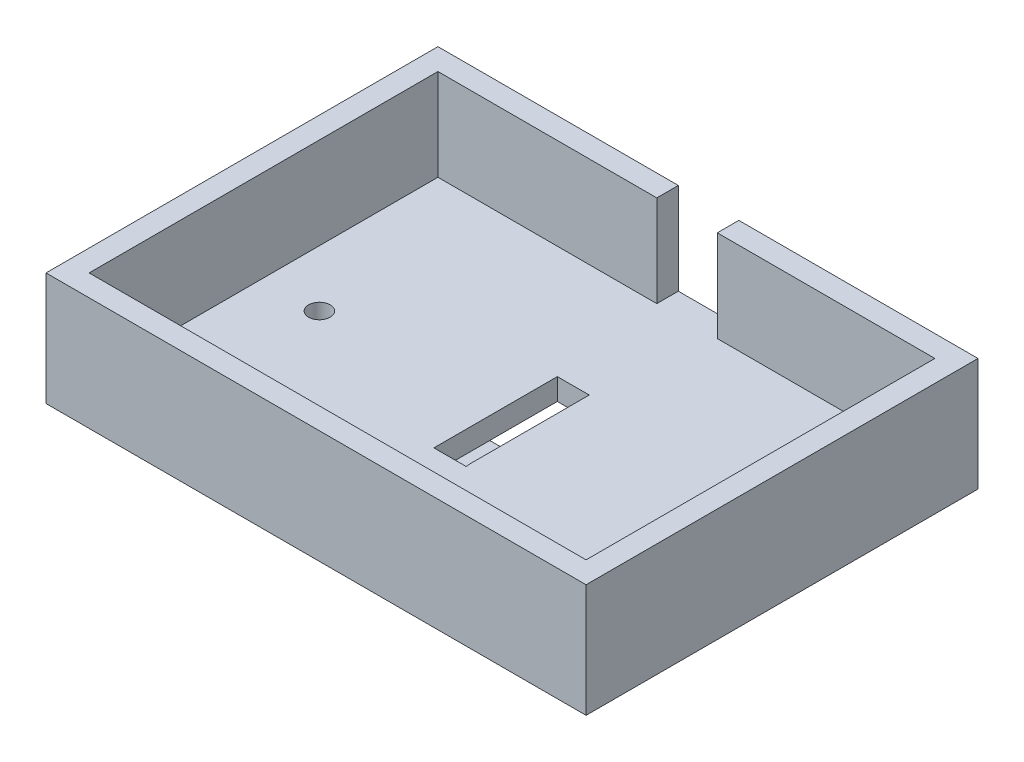
ISO-10303-21;
HEADER;
FILE_DESCRIPTION(('STEP AP214'),'2;1');
FILE_NAME('part.step','',(''),(''),'','','');
FILE_SCHEMA(('AUTOMOTIVE_DESIGN { 1 0 10303 214 1 1 1 1 }'));
ENDSEC;
DATA;
#1=APPLICATION_CONTEXT('core data for automotive mechanical design processes');
#2=APPLICATION_PROTOCOL_DEFINITION('international standard','automotive_design',2000,#1);
#3=PRODUCT_CONTEXT('',#1,'mechanical');
#4=PRODUCT('Part','Part','',(#3));
#5=PRODUCT_RELATED_PRODUCT_CATEGORY('part','',(#4));
#6=PRODUCT_DEFINITION_FORMATION('','',#4);
#7=PRODUCT_DEFINITION_CONTEXT('part definition',#1,'design');
#8=PRODUCT_DEFINITION('design','',#6,#7);
#9=PRODUCT_DEFINITION_SHAPE('','',#8);
#10=(LENGTH_UNIT() NAMED_UNIT(*) SI_UNIT(.MILLI.,.METRE.));
#11=(NAMED_UNIT(*) PLANE_ANGLE_UNIT() SI_UNIT($,.RADIAN.));
#12=(NAMED_UNIT(*) SI_UNIT($,.STERADIAN.) SOLID_ANGLE_UNIT());
#13=UNCERTAINTY_MEASURE_WITH_UNIT(LENGTH_MEASURE(1.E-05),#10,'distance_accuracy_value','');
#14=(GEOMETRIC_REPRESENTATION_CONTEXT(3) GLOBAL_UNCERTAINTY_ASSIGNED_CONTEXT((#13)) GLOBAL_UNIT_ASSIGNED_CONTEXT((#10,
#11,#12)) REPRESENTATION_CONTEXT('',''));
#15=CARTESIAN_POINT('',(0.,0.,0.));
#16=DIRECTION('',(0.,0.,1.));
#17=DIRECTION('',(1.,0.,0.));
#18=AXIS2_PLACEMENT_3D('',#15,#16,#17);
#19=CARTESIAN_POINT('',(0.,21.,-25.9534127843987));
#20=DIRECTION('',(0.,0.,-1.));
#21=DIRECTION('',(-1.,0.,0.));
#22=AXIS2_PLACEMENT_3D('',#19,#20,#21);
#23=PLANE('',#22);
#24=DIRECTION('',(1.,0.,0.));
#25=VECTOR('',#24,1.);
#26=CARTESIAN_POINT('',(0.,21.,-25.9534127843987));
#27=LINE('',#26,#25);
#28=CARTESIAN_POINT('',(9.94358737111857,21.,-25.9534127843987));
#29=VERTEX_POINT('',#28);
#30=CARTESIAN_POINT('',(50.3358613217768,21.,-25.9534127843987));
#31=VERTEX_POINT('',#30);
#32=EDGE_CURVE('E399',#29,#31,#27,.T.);
#33=ORIENTED_EDGE('',*,*,#32,.F.);
#34=DIRECTION('',(0.,-1.,0.));
#35=VECTOR('',#34,1.);
#36=CARTESIAN_POINT('',(9.94358737111857,21.,-25.9534127843987));
#37=LINE('',#36,#35);
#38=CARTESIAN_POINT('',(9.94358737111857,4.,-25.9534127843987));
#39=VERTEX_POINT('',#38);
#40=EDGE_CURVE('E285',#29,#39,#37,.T.);
#41=ORIENTED_EDGE('',*,*,#40,.T.);
#42=DIRECTION('',(-1.,0.,0.));
#43=VECTOR('',#42,1.);
#44=CARTESIAN_POINT('',(0.,4.,-25.9534127843987));
#45=LINE('',#44,#43);
#46=CARTESIAN_POINT('',(50.3358613217768,4.00000000000001,-25.9534127843987));
#47=VERTEX_POINT('',#46);
#48=EDGE_CURVE('E429',#47,#39,#45,.T.);
#49=ORIENTED_EDGE('',*,*,#48,.F.);
#50=DIRECTION('',(0.,-1.,0.));
#51=VECTOR('',#50,1.);
#52=CARTESIAN_POINT('',(50.3358613217768,21.,-25.9534127843987));
#53=LINE('',#52,#51);
#54=EDGE_CURVE('E416',#31,#47,#53,.T.);
#55=ORIENTED_EDGE('',*,*,#54,.F.);
#56=EDGE_LOOP('',(#33,#41,#49,#55));
#57=FACE_BOUND('',#56,.T.);
#58=ADVANCED_FACE('F41',(#57),#23,.F.);
#59=CARTESIAN_POINT('',(0.,-9.5,21.9215872156013));
#60=DIRECTION('',(0.,0.,1.));
#61=DIRECTION('',(1.,0.,0.));
#62=AXIS2_PLACEMENT_3D('',#59,#60,#61);
#63=PLANE('',#62);
#64=DIRECTION('',(1.,0.,0.));
#65=VECTOR('',#64,1.);
#66=CARTESIAN_POINT('',(0.,-5.5,21.9215872156013));
#67=LINE('',#66,#65);
#68=CARTESIAN_POINT('',(8.7108613217768,-5.5,21.9215872156013));
#69=VERTEX_POINT('',#68);
#70=CARTESIAN_POINT('',(12.7108613217768,-5.5,21.9215872156013));
#71=VERTEX_POINT('',#70);
#72=EDGE_CURVE('E64',#69,#71,#67,.T.);
#73=ORIENTED_EDGE('',*,*,#72,.F.);
#74=DIRECTION('',(0.,1.,0.));
#75=VECTOR('',#74,1.);
#76=CARTESIAN_POINT('',(8.7108613217768,-9.5,21.9215872156013));
#77=LINE('',#76,#75);
#78=CARTESIAN_POINT('',(8.7108613217768,0.,21.9215872156013));
#79=VERTEX_POINT('',#78);
#80=EDGE_CURVE('E362',#69,#79,#77,.T.);
#81=ORIENTED_EDGE('',*,*,#80,.T.);
#82=DIRECTION('',(1.,0.,0.));
#83=VECTOR('',#82,1.);
#84=CARTESIAN_POINT('',(0.,0.,21.9215872156013));
#85=LINE('',#84,#83);
#86=CARTESIAN_POINT('',(12.7108613217768,0.,21.9215872156013));
#87=VERTEX_POINT('',#86);
#88=EDGE_CURVE('E353',#79,#87,#85,.T.);
#89=ORIENTED_EDGE('',*,*,#88,.T.);
#90=DIRECTION('',(0.,1.,0.));
#91=VECTOR('',#90,1.);
#92=CARTESIAN_POINT('',(12.7108613217768,-9.5,21.9215872156013));
#93=LINE('',#92,#91);
#94=EDGE_CURVE('E379',#71,#87,#93,.T.);
#95=ORIENTED_EDGE('',*,*,#94,.F.);
#96=EDGE_LOOP('',(#73,#81,#89,#95));
#97=FACE_BOUND('',#96,.T.);
#98=ADVANCED_FACE('F491',(#97),#63,.F.);
#99=CARTESIAN_POINT('',(0.,-9.5,22.0465872156013));
#100=DIRECTION('',(0.,0.,-1.));
#101=DIRECTION('',(-1.,0.,0.));
#102=AXIS2_PLACEMENT_3D('',#99,#100,#101);
#103=PLANE('',#102);
#104=DIRECTION('',(0.,1.,0.));
#105=VECTOR('',#104,1.);
#106=CARTESIAN_POINT('',(-0.289138678223199,-9.5,22.0465872156013));
#107=LINE('',#106,#105);
#108=CARTESIAN_POINT('',(-0.289138678223199,-5.5,22.0465872156013));
#109=VERTEX_POINT('',#108);
#110=CARTESIAN_POINT('',(-0.289138678223199,0.,22.0465872156013));
#111=VERTEX_POINT('',#110);
#112=EDGE_CURVE('E349',#109,#111,#107,.T.);
#113=ORIENTED_EDGE('',*,*,#112,.F.);
#114=DIRECTION('',(1.,0.,0.));
#115=VECTOR('',#114,1.);
#116=CARTESIAN_POINT('',(-4.2891386782232,-5.5,22.0465872156013));
#117=LINE('',#116,#115);
#118=CARTESIAN_POINT('',(-4.2891386782232,-5.5,22.0465872156013));
#119=VERTEX_POINT('',#118);
#120=EDGE_CURVE('E305',#119,#109,#117,.T.);
#121=ORIENTED_EDGE('',*,*,#120,.F.);
#122=DIRECTION('',(0.,1.,0.));
#123=VECTOR('',#122,1.);
#124=CARTESIAN_POINT('',(-4.2891386782232,-9.5,22.0465872156013));
#125=LINE('',#124,#123);
#126=CARTESIAN_POINT('',(-4.2891386782232,0.,22.0465872156013));
#127=VERTEX_POINT('',#126);
#128=EDGE_CURVE('E351',#119,#127,#125,.T.);
#129=ORIENTED_EDGE('',*,*,#128,.T.);
#130=DIRECTION('',(-1.,0.,0.));
#131=VECTOR('',#130,1.);
#132=CARTESIAN_POINT('',(0.,0.,22.0465872156013));
#133=LINE('',#132,#131);
#134=EDGE_CURVE('E336',#111,#127,#133,.T.);
#135=ORIENTED_EDGE('',*,*,#134,.F.);
#136=EDGE_LOOP('',(#113,#121,#129,#135));
#137=FACE_BOUND('',#136,.T.);
#138=ADVANCED_FACE('F497',(#137),#103,.T.);
#139=CARTESIAN_POINT('',(0.,0.,0.));
#140=DIRECTION('',(0.,1.,0.));
#141=DIRECTION('',(0.,0.,1.));
#142=AXIS2_PLACEMENT_3D('',#139,#140,#141);
#143=PLANE('',#142);
#144=ORIENTED_EDGE('',*,*,#134,.T.);
#145=DIRECTION('',(0.,0.,1.));
#146=VECTOR('',#145,1.);
#147=CARTESIAN_POINT('',(-4.28913867822319,0.,0.));
#148=LINE('',#147,#146);
#149=CARTESIAN_POINT('',(-4.2891386782232,0.,26.0465872156013));
#150=VERTEX_POINT('',#149);
#151=EDGE_CURVE('E325',#127,#150,#148,.T.);
#152=ORIENTED_EDGE('',*,*,#151,.T.);
#153=DIRECTION('',(-1.,0.,0.));
#154=VECTOR('',#153,1.);
#155=CARTESIAN_POINT('',(0.,0.,26.0465872156013));
#156=LINE('',#155,#154);
#157=CARTESIAN_POINT('',(-0.2891386782232,0.,26.0465872156013));
#158=VERTEX_POINT('',#157);
#159=EDGE_CURVE('E330',#158,#150,#156,.T.);
#160=ORIENTED_EDGE('',*,*,#159,.F.);
#161=DIRECTION('',(0.,0.,1.));
#162=VECTOR('',#161,1.);
#163=CARTESIAN_POINT('',(-0.289138678223197,0.,0.));
#164=LINE('',#163,#162);
#165=EDGE_CURVE('E339',#111,#158,#164,.T.);
#166=ORIENTED_EDGE('',*,*,#165,.F.);
#167=EDGE_LOOP('',(#144,#152,#160,#166));
#168=FACE_BOUND('',#167,.T.);
#169=DIRECTION('',(0.,0.,1.));
#170=VECTOR('',#169,1.);
#171=CARTESIAN_POINT('',(-45.9141386782232,0.,0.));
#172=LINE('',#171,#170);
#173=CARTESIAN_POINT('',(-45.9141386782232,0.,-29.9534127843987));
#174=VERTEX_POINT('',#173);
#175=CARTESIAN_POINT('',(-45.9141386782232,0.,42.7965872156013));
#176=VERTEX_POINT('',#175);
#177=EDGE_CURVE('E440',#174,#176,#172,.T.);
#178=ORIENTED_EDGE('',*,*,#177,.F.);
#179=DIRECTION('',(1.,0.,0.));
#180=VECTOR('',#179,1.);
#181=CARTESIAN_POINT('',(0.,0.,-29.9534127843987));
#182=LINE('',#181,#180);
#183=CARTESIAN_POINT('',(54.3358613217768,0.,-29.9534127843987));
#184=VERTEX_POINT('',#183);
#185=EDGE_CURVE('E449',#174,#184,#182,.T.);
#186=ORIENTED_EDGE('',*,*,#185,.T.);
#187=DIRECTION('',(0.,0.,1.));
#188=VECTOR('',#187,1.);
#189=CARTESIAN_POINT('',(54.3358613217768,0.,0.));
#190=LINE('',#189,#188);
#191=CARTESIAN_POINT('',(54.3358613217768,0.,42.7965872156013));
#192=VERTEX_POINT('',#191);
#193=EDGE_CURVE('E446',#184,#192,#190,.T.);
#194=ORIENTED_EDGE('',*,*,#193,.T.);
#195=DIRECTION('',(1.,0.,0.));
#196=VECTOR('',#195,1.);
#197=CARTESIAN_POINT('',(0.,0.,42.7965872156013));
#198=LINE('',#197,#196);
#199=EDGE_CURVE('E443',#176,#192,#198,.T.);
#200=ORIENTED_EDGE('',*,*,#199,.F.);
#201=EDGE_LOOP('',(#178,#186,#194,#200));
#202=FACE_BOUND('',#201,.T.);
#203=DIRECTION('',(1.,0.,0.));
#204=VECTOR('',#203,1.);
#205=CARTESIAN_POINT('',(1.2108613217768,0.,-4.9913300942934));
#206=LINE('',#205,#204);
#207=CARTESIAN_POINT('',(1.2108613217768,0.,-4.9913300942934));
#208=VERTEX_POINT('',#207);
#209=CARTESIAN_POINT('',(7.12923287133893,0.,-4.9913300942934));
#210=VERTEX_POINT('',#209);
#211=EDGE_CURVE('E249',#208,#210,#206,.T.);
#212=ORIENTED_EDGE('',*,*,#211,.F.);
#213=DIRECTION('',(0.,0.,-1.));
#214=VECTOR('',#213,1.);
#215=CARTESIAN_POINT('',(1.2108613217768,0.,0.));
#216=LINE('',#215,#214);
#217=CARTESIAN_POINT('',(1.2108613217768,0.,17.9215872156013));
#218=VERTEX_POINT('',#217);
#219=EDGE_CURVE('E233',#218,#208,#216,.T.);
#220=ORIENTED_EDGE('',*,*,#219,.F.);
#221=DIRECTION('',(-1.,0.,0.));
#222=VECTOR('',#221,1.);
#223=CARTESIAN_POINT('',(0.,0.,17.9215872156013));
#224=LINE('',#223,#222);
#225=CARTESIAN_POINT('',(7.2108613217768,0.,17.9215872156013));
#226=VERTEX_POINT('',#225);
#227=EDGE_CURVE('E243',#226,#218,#224,.T.);
#228=ORIENTED_EDGE('',*,*,#227,.F.);
#229=DIRECTION('',(0.104256433001153,0.,0.994550449287454));
#230=VECTOR('',#229,1.);
#231=CARTESIAN_POINT('',(5.27422496400508,0.,-0.552884855651879));
#232=LINE('',#231,#230);
#233=CARTESIAN_POINT('',(7.12923287133897,0.,17.1428955826672));
#234=VERTEX_POINT('',#233);
#235=EDGE_CURVE('E385',#234,#226,#232,.T.);
#236=ORIENTED_EDGE('',*,*,#235,.F.);
#237=DIRECTION('',(0.,0.,1.));
#238=VECTOR('',#237,1.);
#239=CARTESIAN_POINT('',(7.12923287133893,0.,17.9215872156013));
#240=LINE('',#239,#238);
#241=EDGE_CURVE('E253',#210,#234,#240,.T.);
#242=ORIENTED_EDGE('',*,*,#241,.F.);
#243=EDGE_LOOP('',(#212,#220,#228,#236,#242));
#244=FACE_BOUND('',#243,.T.);
#245=CARTESIAN_POINT('',(-31.4146774412977,0.,6.54658257109205));
#246=DIRECTION('',(0.,-1.,0.));
#247=DIRECTION('',(0.,0.,-1.));
#248=AXIS2_PLACEMENT_3D('',#245,#246,#247);
#249=CIRCLE('',#248,2.);
#250=CARTESIAN_POINT('',(-31.4146774412977,0.,4.54658257109204));
#251=VERTEX_POINT('',#250);
#252=EDGE_CURVE('E381',#251,#251,#249,.T.);
#253=ORIENTED_EDGE('',*,*,#252,.F.);
#254=EDGE_LOOP('',(#253));
#255=FACE_BOUND('',#254,.T.);
#256=ORIENTED_EDGE('',*,*,#88,.F.);
#257=DIRECTION('',(0.,0.,1.));
#258=VECTOR('',#257,1.);
#259=CARTESIAN_POINT('',(8.71086132177682,0.,0.));
#260=LINE('',#259,#258);
#261=CARTESIAN_POINT('',(8.7108613217768,0.,25.9215872156013));
#262=VERTEX_POINT('',#261);
#263=EDGE_CURVE('E357',#79,#262,#260,.T.);
#264=ORIENTED_EDGE('',*,*,#263,.T.);
#265=DIRECTION('',(1.,0.,0.));
#266=VECTOR('',#265,1.);
#267=CARTESIAN_POINT('',(0.,0.,25.9215872156013));
#268=LINE('',#267,#266);
#269=CARTESIAN_POINT('',(12.7108613217768,0.,25.9215872156013));
#270=VERTEX_POINT('',#269);
#271=EDGE_CURVE('E368',#262,#270,#268,.T.);
#272=ORIENTED_EDGE('',*,*,#271,.T.);
#273=DIRECTION('',(0.,0.,1.));
#274=VECTOR('',#273,1.);
#275=CARTESIAN_POINT('',(12.7108613217768,0.,0.));
#276=LINE('',#275,#274);
#277=EDGE_CURVE('E365',#87,#270,#276,.T.);
#278=ORIENTED_EDGE('',*,*,#277,.F.);
#279=EDGE_LOOP('',(#256,#264,#272,#278));
#280=FACE_BOUND('',#279,.T.);
#281=ADVANCED_FACE('F255',(#168,#202,#244,#255,#280),#143,.F.);
#282=CARTESIAN_POINT('',(-45.9141386782232,4.,0.));
#283=DIRECTION('',(1.,0.,0.));
#284=DIRECTION('',(0.,0.,-1.));
#285=AXIS2_PLACEMENT_3D('',#282,#283,#284);
#286=PLANE('',#285);
#287=ORIENTED_EDGE('',*,*,#177,.T.);
#288=DIRECTION('',(0.,-1.,0.));
#289=VECTOR('',#288,1.);
#290=CARTESIAN_POINT('',(-45.9141386782232,4.,42.7965872156013));
#291=LINE('',#290,#289);
#292=CARTESIAN_POINT('',(-45.9141386782232,21.,42.7965872156013));
#293=VERTEX_POINT('',#292);
#294=EDGE_CURVE('E458',#293,#176,#291,.T.);
#295=ORIENTED_EDGE('',*,*,#294,.F.);
#296=DIRECTION('',(0.,0.,1.));
#297=VECTOR('',#296,1.);
#298=CARTESIAN_POINT('',(-45.9141386782232,21.,0.));
#299=LINE('',#298,#297);
#300=CARTESIAN_POINT('',(-45.9141386782232,21.,-29.9534127843987));
#301=VERTEX_POINT('',#300);
#302=EDGE_CURVE('E403',#301,#293,#299,.T.);
#303=ORIENTED_EDGE('',*,*,#302,.F.);
#304=DIRECTION('',(0.,-1.,0.));
#305=VECTOR('',#304,1.);
#306=CARTESIAN_POINT('',(-45.9141386782232,4.,-29.9534127843987));
#307=LINE('',#306,#305);
#308=EDGE_CURVE('E452',#301,#174,#307,.T.);
#309=ORIENTED_EDGE('',*,*,#308,.T.);
#310=EDGE_LOOP('',(#287,#295,#303,#309));
#311=FACE_BOUND('',#310,.T.);
#312=ADVANCED_FACE('F43',(#311),#286,.F.);
#313=CARTESIAN_POINT('',(0.,4.,42.7965872156013));
#314=DIRECTION('',(0.,0.,-1.));
#315=DIRECTION('',(-1.,0.,0.));
#316=AXIS2_PLACEMENT_3D('',#313,#314,#315);
#317=PLANE('',#316);
#318=ORIENTED_EDGE('',*,*,#199,.T.);
#319=DIRECTION('',(0.,-1.,0.));
#320=VECTOR('',#319,1.);
#321=CARTESIAN_POINT('',(54.3358613217768,4.,42.7965872156013));
#322=LINE('',#321,#320);
#323=CARTESIAN_POINT('',(54.3358613217768,21.,42.7965872156013));
#324=VERTEX_POINT('',#323);
#325=EDGE_CURVE('E456',#324,#192,#322,.T.);
#326=ORIENTED_EDGE('',*,*,#325,.F.);
#327=DIRECTION('',(1.,0.,0.));
#328=VECTOR('',#327,1.);
#329=CARTESIAN_POINT('',(0.,21.,42.7965872156013));
#330=LINE('',#329,#328);
#331=EDGE_CURVE('E406',#293,#324,#330,.T.);
#332=ORIENTED_EDGE('',*,*,#331,.F.);
#333=ORIENTED_EDGE('',*,*,#294,.T.);
#334=EDGE_LOOP('',(#318,#326,#332,#333));
#335=FACE_BOUND('',#334,.T.);
#336=ADVANCED_FACE('F788',(#335),#317,.F.);
#337=CARTESIAN_POINT('',(54.3358613217768,4.,0.));
#338=DIRECTION('',(1.,0.,0.));
#339=DIRECTION('',(0.,0.,-1.));
#340=AXIS2_PLACEMENT_3D('',#337,#338,#339);
#341=PLANE('',#340);
#342=ORIENTED_EDGE('',*,*,#193,.F.);
#343=DIRECTION('',(0.,-1.,0.));
#344=VECTOR('',#343,1.);
#345=CARTESIAN_POINT('',(54.3358613217768,4.,-29.9534127843987));
#346=LINE('',#345,#344);
#347=CARTESIAN_POINT('',(54.3358613217768,21.,-29.9534127843987));
#348=VERTEX_POINT('',#347);
#349=EDGE_CURVE('E454',#348,#184,#346,.T.);
#350=ORIENTED_EDGE('',*,*,#349,.F.);
#351=DIRECTION('',(0.,0.,1.));
#352=VECTOR('',#351,1.);
#353=CARTESIAN_POINT('',(54.3358613217768,21.,0.));
#354=LINE('',#353,#352);
#355=EDGE_CURVE('E409',#348,#324,#354,.T.);
#356=ORIENTED_EDGE('',*,*,#355,.T.);
#357=ORIENTED_EDGE('',*,*,#325,.T.);
#358=EDGE_LOOP('',(#342,#350,#356,#357));
#359=FACE_BOUND('',#358,.T.);
#360=ADVANCED_FACE('F533',(#359),#341,.T.);
#361=CARTESIAN_POINT('',(0.,4.,-29.9534127843987));
#362=DIRECTION('',(0.,0.,-1.));
#363=DIRECTION('',(-1.,0.,0.));
#364=AXIS2_PLACEMENT_3D('',#361,#362,#363);
#365=PLANE('',#364);
#366=DIRECTION('',(0.,-1.,0.));
#367=VECTOR('',#366,1.);
#368=CARTESIAN_POINT('',(9.94358737111857,0.,-29.9534127843987));
#369=LINE('',#368,#367);
#370=CARTESIAN_POINT('',(9.94358737111857,21.,-29.9534127843987));
#371=VERTEX_POINT('',#370);
#372=CARTESIAN_POINT('',(9.94358737111857,4.,-29.9534127843987));
#373=VERTEX_POINT('',#372);
#374=EDGE_CURVE('E267',#371,#373,#369,.T.);
#375=ORIENTED_EDGE('',*,*,#374,.F.);
#376=DIRECTION('',(1.,0.,0.));
#377=VECTOR('',#376,1.);
#378=CARTESIAN_POINT('',(0.,21.,-29.9534127843987));
#379=LINE('',#378,#377);
#380=EDGE_CURVE('E412',#371,#348,#379,.T.);
#381=ORIENTED_EDGE('',*,*,#380,.T.);
#382=ORIENTED_EDGE('',*,*,#349,.T.);
#383=ORIENTED_EDGE('',*,*,#185,.F.);
#384=ORIENTED_EDGE('',*,*,#308,.F.);
#385=CARTESIAN_POINT('',(-1.28913867822321,21.,-29.9534127843987));
#386=VERTEX_POINT('',#385);
#387=EDGE_CURVE('E413',#301,#386,#379,.T.);
#388=ORIENTED_EDGE('',*,*,#387,.T.);
#389=DIRECTION('',(0.,1.,0.));
#390=VECTOR('',#389,1.);
#391=CARTESIAN_POINT('',(-1.28913867822321,0.,-29.9534127843987));
#392=LINE('',#391,#390);
#393=CARTESIAN_POINT('',(-1.28913867822321,4.,-29.9534127843987));
#394=VERTEX_POINT('',#393);
#395=EDGE_CURVE('E56',#394,#386,#392,.T.);
#396=ORIENTED_EDGE('',*,*,#395,.F.);
#397=DIRECTION('',(-1.,0.,0.));
#398=VECTOR('',#397,1.);
#399=CARTESIAN_POINT('',(0.,4.,-29.9534127843987));
#400=LINE('',#399,#398);
#401=EDGE_CURVE('E270',#373,#394,#400,.T.);
#402=ORIENTED_EDGE('',*,*,#401,.F.);
#403=EDGE_LOOP('',(#375,#381,#382,#383,#384,#388,#396,#402));
#404=FACE_BOUND('',#403,.T.);
#405=ADVANCED_FACE('F521',(#404),#365,.T.);
#406=CARTESIAN_POINT('',(50.3358613217768,21.,0.));
#407=DIRECTION('',(1.,0.,0.));
#408=DIRECTION('',(0.,0.,-1.));
#409=AXIS2_PLACEMENT_3D('',#406,#407,#408);
#410=PLANE('',#409);
#411=DIRECTION('',(0.,0.,-1.));
#412=VECTOR('',#411,1.);
#413=CARTESIAN_POINT('',(50.3358613217768,4.,0.));
#414=LINE('',#413,#412);
#415=CARTESIAN_POINT('',(50.3358613217768,4.00000000000001,38.7965872156013));
#416=VERTEX_POINT('',#415);
#417=EDGE_CURVE('E437',#416,#47,#414,.T.);
#418=ORIENTED_EDGE('',*,*,#417,.F.);
#419=DIRECTION('',(0.,-1.,0.));
#420=VECTOR('',#419,1.);
#421=CARTESIAN_POINT('',(50.3358613217768,21.,38.7965872156013));
#422=LINE('',#421,#420);
#423=CARTESIAN_POINT('',(50.3358613217768,21.,38.7965872156013));
#424=VERTEX_POINT('',#423);
#425=EDGE_CURVE('E425',#424,#416,#422,.T.);
#426=ORIENTED_EDGE('',*,*,#425,.F.);
#427=DIRECTION('',(0.,0.,1.));
#428=VECTOR('',#427,1.);
#429=CARTESIAN_POINT('',(50.3358613217768,21.,0.));
#430=LINE('',#429,#428);
#431=EDGE_CURVE('E389',#31,#424,#430,.T.);
#432=ORIENTED_EDGE('',*,*,#431,.F.);
#433=ORIENTED_EDGE('',*,*,#54,.T.);
#434=EDGE_LOOP('',(#418,#426,#432,#433));
#435=FACE_BOUND('',#434,.T.);
#436=ADVANCED_FACE('F539',(#435),#410,.F.);
#437=CARTESIAN_POINT('',(0.,21.,38.7965872156013));
#438=DIRECTION('',(0.,0.,-1.));
#439=DIRECTION('',(-1.,0.,0.));
#440=AXIS2_PLACEMENT_3D('',#437,#438,#439);
#441=PLANE('',#440);
#442=ORIENTED_EDGE('',*,*,#425,.T.);
#443=DIRECTION('',(-1.,0.,0.));
#444=VECTOR('',#443,1.);
#445=CARTESIAN_POINT('',(0.,4.,38.7965872156013));
#446=LINE('',#445,#444);
#447=CARTESIAN_POINT('',(-41.9141386782232,4.00000000000001,38.7965872156013));
#448=VERTEX_POINT('',#447);
#449=EDGE_CURVE('E435',#416,#448,#446,.T.);
#450=ORIENTED_EDGE('',*,*,#449,.T.);
#451=DIRECTION('',(0.,-1.,0.));
#452=VECTOR('',#451,1.);
#453=CARTESIAN_POINT('',(-41.9141386782232,21.,38.7965872156013));
#454=LINE('',#453,#452);
#455=CARTESIAN_POINT('',(-41.9141386782232,21.,38.7965872156013));
#456=VERTEX_POINT('',#455);
#457=EDGE_CURVE('E422',#456,#448,#454,.T.);
#458=ORIENTED_EDGE('',*,*,#457,.F.);
#459=DIRECTION('',(1.,0.,0.));
#460=VECTOR('',#459,1.);
#461=CARTESIAN_POINT('',(0.,21.,38.7965872156013));
#462=LINE('',#461,#460);
#463=EDGE_CURVE('E393',#456,#424,#462,.T.);
#464=ORIENTED_EDGE('',*,*,#463,.T.);
#465=EDGE_LOOP('',(#442,#450,#458,#464));
#466=FACE_BOUND('',#465,.T.);
#467=ADVANCED_FACE('F507',(#466),#441,.T.);
#468=CARTESIAN_POINT('',(-41.9141386782232,21.,0.));
#469=DIRECTION('',(1.,0.,0.));
#470=DIRECTION('',(0.,0.,-1.));
#471=AXIS2_PLACEMENT_3D('',#468,#469,#470);
#472=PLANE('',#471);
#473=ORIENTED_EDGE('',*,*,#457,.T.);
#474=DIRECTION('',(0.,0.,-1.));
#475=VECTOR('',#474,1.);
#476=CARTESIAN_POINT('',(-41.9141386782232,4.,0.));
#477=LINE('',#476,#475);
#478=CARTESIAN_POINT('',(-41.9141386782232,4.,-25.9534127843987));
#479=VERTEX_POINT('',#478);
#480=EDGE_CURVE('E432',#448,#479,#477,.T.);
#481=ORIENTED_EDGE('',*,*,#480,.T.);
#482=DIRECTION('',(0.,-1.,0.));
#483=VECTOR('',#482,1.);
#484=CARTESIAN_POINT('',(-41.9141386782232,21.,-25.9534127843987));
#485=LINE('',#484,#483);
#486=CARTESIAN_POINT('',(-41.9141386782232,21.,-25.9534127843987));
#487=VERTEX_POINT('',#486);
#488=EDGE_CURVE('E419',#487,#479,#485,.T.);
#489=ORIENTED_EDGE('',*,*,#488,.F.);
#490=DIRECTION('',(0.,0.,1.));
#491=VECTOR('',#490,1.);
#492=CARTESIAN_POINT('',(-41.9141386782232,21.,0.));
#493=LINE('',#492,#491);
#494=EDGE_CURVE('E396',#487,#456,#493,.T.);
#495=ORIENTED_EDGE('',*,*,#494,.T.);
#496=EDGE_LOOP('',(#473,#481,#489,#495));
#497=FACE_BOUND('',#496,.T.);
#498=ADVANCED_FACE('F502',(#497),#472,.T.);
#499=CARTESIAN_POINT('',(-1.28913867822321,4.,-25.9534127843987));
#500=VERTEX_POINT('',#499);
#501=EDGE_CURVE('E428',#500,#479,#45,.T.);
#502=ORIENTED_EDGE('',*,*,#501,.F.);
#503=DIRECTION('',(0.,1.,0.));
#504=VECTOR('',#503,1.);
#505=CARTESIAN_POINT('',(-1.28913867822321,21.,-25.9534127843987));
#506=LINE('',#505,#504);
#507=CARTESIAN_POINT('',(-1.28913867822321,21.,-25.9534127843987));
#508=VERTEX_POINT('',#507);
#509=EDGE_CURVE('E277',#500,#508,#506,.T.);
#510=ORIENTED_EDGE('',*,*,#509,.T.);
#511=EDGE_CURVE('E400',#487,#508,#27,.T.);
#512=ORIENTED_EDGE('',*,*,#511,.F.);
#513=ORIENTED_EDGE('',*,*,#488,.T.);
#514=EDGE_LOOP('',(#502,#510,#512,#513));
#515=FACE_BOUND('',#514,.T.);
#516=ADVANCED_FACE('F484',(#515),#23,.F.);
#517=CARTESIAN_POINT('',(0.,21.,0.));
#518=DIRECTION('',(0.,1.,0.));
#519=DIRECTION('',(0.,0.,1.));
#520=AXIS2_PLACEMENT_3D('',#517,#518,#519);
#521=PLANE('',#520);
#522=DIRECTION('',(0.,0.,-1.));
#523=VECTOR('',#522,1.);
#524=CARTESIAN_POINT('',(9.94358737111857,21.,-19.9534127843987));
#525=LINE('',#524,#523);
#526=EDGE_CURVE('E275',#29,#371,#525,.T.);
#527=ORIENTED_EDGE('',*,*,#526,.F.);
#528=ORIENTED_EDGE('',*,*,#32,.T.);
#529=ORIENTED_EDGE('',*,*,#431,.T.);
#530=ORIENTED_EDGE('',*,*,#463,.F.);
#531=ORIENTED_EDGE('',*,*,#494,.F.);
#532=ORIENTED_EDGE('',*,*,#511,.T.);
#533=DIRECTION('',(0.,0.,-1.));
#534=VECTOR('',#533,1.);
#535=CARTESIAN_POINT('',(-1.28913867822321,21.,-19.9534127843987));
#536=LINE('',#535,#534);
#537=EDGE_CURVE('E278',#508,#386,#536,.T.);
#538=ORIENTED_EDGE('',*,*,#537,.T.);
#539=ORIENTED_EDGE('',*,*,#387,.F.);
#540=ORIENTED_EDGE('',*,*,#302,.T.);
#541=ORIENTED_EDGE('',*,*,#331,.T.);
#542=ORIENTED_EDGE('',*,*,#355,.F.);
#543=ORIENTED_EDGE('',*,*,#380,.F.);
#544=EDGE_LOOP('',(#527,#528,#529,#530,#531,#532,#538,#539,#540,#541,#542,#543));
#545=FACE_BOUND('',#544,.T.);
#546=ADVANCED_FACE('F475',(#545),#521,.T.);
#547=CARTESIAN_POINT('',(0.,4.,0.));
#548=DIRECTION('',(0.,1.,0.));
#549=DIRECTION('',(0.,0.,1.));
#550=AXIS2_PLACEMENT_3D('',#547,#548,#549);
#551=PLANE('',#550);
#552=DIRECTION('',(0.,0.,1.));
#553=VECTOR('',#552,1.);
#554=CARTESIAN_POINT('',(1.2108613217768,4.,0.));
#555=LINE('',#554,#553);
#556=CARTESIAN_POINT('',(1.2108613217768,4.,-4.9913300942934));
#557=VERTEX_POINT('',#556);
#558=CARTESIAN_POINT('',(1.2108613217768,4.,17.9215872156013));
#559=VERTEX_POINT('',#558);
#560=EDGE_CURVE('E463',#557,#559,#555,.T.);
#561=ORIENTED_EDGE('',*,*,#560,.F.);
#562=DIRECTION('',(-1.,0.,0.));
#563=VECTOR('',#562,1.);
#564=CARTESIAN_POINT('',(0.,4.,-4.9913300942934));
#565=LINE('',#564,#563);
#566=CARTESIAN_POINT('',(7.12923287133893,4.,-4.9913300942934));
#567=VERTEX_POINT('',#566);
#568=EDGE_CURVE('E11',#567,#557,#565,.T.);
#569=ORIENTED_EDGE('',*,*,#568,.F.);
#570=DIRECTION('',(0.,0.,-1.));
#571=VECTOR('',#570,1.);
#572=CARTESIAN_POINT('',(7.12923287133893,4.,0.));
#573=LINE('',#572,#571);
#574=CARTESIAN_POINT('',(7.12923287133893,4.00000000000001,17.1428955826665));
#575=VERTEX_POINT('',#574);
#576=EDGE_CURVE('E265',#575,#567,#573,.T.);
#577=ORIENTED_EDGE('',*,*,#576,.F.);
#578=DIRECTION('',(-0.104256433001153,0.,-0.994550449287454));
#579=VECTOR('',#578,1.);
#580=CARTESIAN_POINT('',(5.27422496400508,4.,-0.552884855651879));
#581=LINE('',#580,#579);
#582=CARTESIAN_POINT('',(7.2108613217768,4.00000000000001,17.9215872156013));
#583=VERTEX_POINT('',#582);
#584=EDGE_CURVE('E49',#583,#575,#581,.T.);
#585=ORIENTED_EDGE('',*,*,#584,.F.);
#586=DIRECTION('',(1.,0.,0.));
#587=VECTOR('',#586,1.);
#588=CARTESIAN_POINT('',(0.,4.,17.9215872156013));
#589=LINE('',#588,#587);
#590=EDGE_CURVE('E461',#559,#583,#589,.T.);
#591=ORIENTED_EDGE('',*,*,#590,.F.);
#592=EDGE_LOOP('',(#561,#569,#577,#585,#591));
#593=FACE_BOUND('',#592,.T.);
#594=ORIENTED_EDGE('',*,*,#48,.T.);
#595=DIRECTION('',(0.,0.,-1.));
#596=VECTOR('',#595,1.);
#597=CARTESIAN_POINT('',(9.94358737111857,4.,-19.9534127843987));
#598=LINE('',#597,#596);
#599=EDGE_CURVE('E274',#39,#373,#598,.T.);
#600=ORIENTED_EDGE('',*,*,#599,.T.);
#601=ORIENTED_EDGE('',*,*,#401,.T.);
#602=DIRECTION('',(0.,0.,-1.));
#603=VECTOR('',#602,1.);
#604=CARTESIAN_POINT('',(-1.28913867822321,4.,-19.9534127843987));
#605=LINE('',#604,#603);
#606=EDGE_CURVE('E280',#500,#394,#605,.T.);
#607=ORIENTED_EDGE('',*,*,#606,.F.);
#608=ORIENTED_EDGE('',*,*,#501,.T.);
#609=ORIENTED_EDGE('',*,*,#480,.F.);
#610=ORIENTED_EDGE('',*,*,#449,.F.);
#611=ORIENTED_EDGE('',*,*,#417,.T.);
#612=EDGE_LOOP('',(#594,#600,#601,#607,#608,#609,#610,#611));
#613=FACE_BOUND('',#612,.T.);
#614=CARTESIAN_POINT('',(-31.4146774412977,4.,6.54658257109205));
#615=DIRECTION('',(0.,1.,0.));
#616=DIRECTION('',(0.,0.,1.));
#617=AXIS2_PLACEMENT_3D('',#614,#615,#616);
#618=CIRCLE('',#617,2.);
#619=CARTESIAN_POINT('',(-31.4146774412977,4.,8.54658257109205));
#620=VERTEX_POINT('',#619);
#621=EDGE_CURVE('E384',#620,#620,#618,.T.);
#622=ORIENTED_EDGE('',*,*,#621,.F.);
#623=EDGE_LOOP('',(#622));
#624=FACE_BOUND('',#623,.T.);
#625=ADVANCED_FACE('F472',(#593,#613,#624),#551,.T.);
#626=CARTESIAN_POINT('',(5.27422496400508,21.,-0.552884855651879));
#627=DIRECTION('',(0.994550449287454,0.,-0.104256433001153));
#628=DIRECTION('',(-0.104256433001153,0.,-0.994550449287454));
#629=AXIS2_PLACEMENT_3D('',#626,#627,#628);
#630=PLANE('',#629);
#631=ORIENTED_EDGE('',*,*,#584,.T.);
#632=DIRECTION('',(0.,-1.,0.));
#633=VECTOR('',#632,1.);
#634=CARTESIAN_POINT('',(7.12923287133893,21.,17.1428955826665));
#635=LINE('',#634,#633);
#636=EDGE_CURVE('E261',#575,#234,#635,.T.);
#637=ORIENTED_EDGE('',*,*,#636,.T.);
#638=ORIENTED_EDGE('',*,*,#235,.T.);
#639=DIRECTION('',(0.,-1.,0.));
#640=VECTOR('',#639,1.);
#641=CARTESIAN_POINT('',(7.2108613217768,21.,17.9215872156013));
#642=LINE('',#641,#640);
#643=EDGE_CURVE('E242',#583,#226,#642,.T.);
#644=ORIENTED_EDGE('',*,*,#643,.F.);
#645=EDGE_LOOP('',(#631,#637,#638,#644));
#646=FACE_BOUND('',#645,.T.);
#647=ADVANCED_FACE('F474',(#646),#630,.F.);
#648=CARTESIAN_POINT('',(1.2108613217768,21.,0.));
#649=DIRECTION('',(-1.,0.,0.));
#650=DIRECTION('',(0.,0.,1.));
#651=AXIS2_PLACEMENT_3D('',#648,#649,#650);
#652=PLANE('',#651);
#653=ORIENTED_EDGE('',*,*,#560,.T.);
#654=DIRECTION('',(0.,-1.,0.));
#655=VECTOR('',#654,1.);
#656=CARTESIAN_POINT('',(1.2108613217768,21.,17.9215872156013));
#657=LINE('',#656,#655);
#658=EDGE_CURVE('E238',#559,#218,#657,.T.);
#659=ORIENTED_EDGE('',*,*,#658,.T.);
#660=ORIENTED_EDGE('',*,*,#219,.T.);
#661=DIRECTION('',(0.,-1.,0.));
#662=VECTOR('',#661,1.);
#663=CARTESIAN_POINT('',(1.2108613217768,10.,-4.9913300942934));
#664=LINE('',#663,#662);
#665=EDGE_CURVE('E237',#557,#208,#664,.T.);
#666=ORIENTED_EDGE('',*,*,#665,.F.);
#667=EDGE_LOOP('',(#653,#659,#660,#666));
#668=FACE_BOUND('',#667,.T.);
#669=ADVANCED_FACE('F236',(#668),#652,.F.);
#670=CARTESIAN_POINT('',(0.,21.,17.9215872156013));
#671=DIRECTION('',(0.,0.,1.));
#672=DIRECTION('',(1.,0.,0.));
#673=AXIS2_PLACEMENT_3D('',#670,#671,#672);
#674=PLANE('',#673);
#675=ORIENTED_EDGE('',*,*,#227,.T.);
#676=ORIENTED_EDGE('',*,*,#658,.F.);
#677=ORIENTED_EDGE('',*,*,#590,.T.);
#678=ORIENTED_EDGE('',*,*,#643,.T.);
#679=EDGE_LOOP('',(#675,#676,#677,#678));
#680=FACE_BOUND('',#679,.T.);
#681=ADVANCED_FACE('F605',(#680),#674,.F.);
#682=CARTESIAN_POINT('',(-31.4146774412977,21.,6.54658257109205));
#683=DIRECTION('',(0.,-1.,0.));
#684=DIRECTION('',(0.,0.,-1.));
#685=AXIS2_PLACEMENT_3D('',#682,#683,#684);
#686=CYLINDRICAL_SURFACE('',#685,2.);
#687=ORIENTED_EDGE('',*,*,#621,.T.);
#688=EDGE_LOOP('',(#687));
#689=FACE_BOUND('',#688,.T.);
#690=ORIENTED_EDGE('',*,*,#252,.T.);
#691=EDGE_LOOP('',(#690));
#692=FACE_BOUND('',#691,.T.);
#693=ADVANCED_FACE('F469',(#689,#692),#686,.F.);
#694=CARTESIAN_POINT('',(12.7108613217768,-9.5,0.));
#695=DIRECTION('',(-1.,0.,0.));
#696=DIRECTION('',(0.,0.,1.));
#697=AXIS2_PLACEMENT_3D('',#694,#695,#696);
#698=PLANE('',#697);
#699=DIRECTION('',(0.,0.,1.));
#700=VECTOR('',#699,1.);
#701=CARTESIAN_POINT('',(12.7108613217768,-9.5,0.));
#702=LINE('',#701,#700);
#703=CARTESIAN_POINT('',(12.7108613217768,-9.5,2.0465872156013));
#704=VERTEX_POINT('',#703);
#705=CARTESIAN_POINT('',(12.7108613217768,-9.5,25.9215872156013));
#706=VERTEX_POINT('',#705);
#707=EDGE_CURVE('E354',#704,#706,#702,.T.);
#708=ORIENTED_EDGE('',*,*,#707,.F.);
#709=DIRECTION('',(0.,-1.,0.));
#710=VECTOR('',#709,1.);
#711=CARTESIAN_POINT('',(12.7108613217768,-9.5,2.0465872156013));
#712=LINE('',#711,#710);
#713=CARTESIAN_POINT('',(12.7108613217768,-5.5,2.0465872156013));
#714=VERTEX_POINT('',#713);
#715=EDGE_CURVE('E301',#714,#704,#712,.T.);
#716=ORIENTED_EDGE('',*,*,#715,.F.);
#717=DIRECTION('',(0.,0.,1.));
#718=VECTOR('',#717,1.);
#719=CARTESIAN_POINT('',(12.7108613217768,-5.5,2.0465872156013));
#720=LINE('',#719,#718);
#721=EDGE_CURVE('E291',#714,#71,#720,.T.);
#722=ORIENTED_EDGE('',*,*,#721,.T.);
#723=ORIENTED_EDGE('',*,*,#94,.T.);
#724=ORIENTED_EDGE('',*,*,#277,.T.);
#725=DIRECTION('',(0.,1.,0.));
#726=VECTOR('',#725,1.);
#727=CARTESIAN_POINT('',(12.7108613217768,-9.5,25.9215872156013));
#728=LINE('',#727,#726);
#729=EDGE_CURVE('E377',#706,#270,#728,.T.);
#730=ORIENTED_EDGE('',*,*,#729,.F.);
#731=EDGE_LOOP('',(#708,#716,#722,#723,#724,#730));
#732=FACE_BOUND('',#731,.T.);
#733=ADVANCED_FACE('F598',(#732),#698,.F.);
#734=CARTESIAN_POINT('',(0.,-9.5,25.9215872156013));
#735=DIRECTION('',(0.,0.,1.));
#736=DIRECTION('',(1.,0.,0.));
#737=AXIS2_PLACEMENT_3D('',#734,#735,#736);
#738=PLANE('',#737);
#739=ORIENTED_EDGE('',*,*,#271,.F.);
#740=DIRECTION('',(0.,1.,0.));
#741=VECTOR('',#740,1.);
#742=CARTESIAN_POINT('',(8.7108613217768,-9.5,25.9215872156013));
#743=LINE('',#742,#741);
#744=CARTESIAN_POINT('',(8.7108613217768,-9.5,25.9215872156013));
#745=VERTEX_POINT('',#744);
#746=EDGE_CURVE('E374',#745,#262,#743,.T.);
#747=ORIENTED_EDGE('',*,*,#746,.F.);
#748=DIRECTION('',(1.,0.,0.));
#749=VECTOR('',#748,1.);
#750=CARTESIAN_POINT('',(0.,-9.5,25.9215872156013));
#751=LINE('',#750,#749);
#752=EDGE_CURVE('E356',#745,#706,#751,.T.);
#753=ORIENTED_EDGE('',*,*,#752,.T.);
#754=ORIENTED_EDGE('',*,*,#729,.T.);
#755=EDGE_LOOP('',(#739,#747,#753,#754));
#756=FACE_BOUND('',#755,.T.);
#757=ADVANCED_FACE('F594',(#756),#738,.T.);
#758=CARTESIAN_POINT('',(8.71086132177682,-9.5,0.));
#759=DIRECTION('',(-1.,0.,0.));
#760=DIRECTION('',(0.,0.,1.));
#761=AXIS2_PLACEMENT_3D('',#758,#759,#760);
#762=PLANE('',#761);
#763=ORIENTED_EDGE('',*,*,#80,.F.);
#764=DIRECTION('',(0.,0.,1.));
#765=VECTOR('',#764,1.);
#766=CARTESIAN_POINT('',(8.7108613217768,-5.5,2.0465872156013));
#767=LINE('',#766,#765);
#768=CARTESIAN_POINT('',(8.7108613217768,-5.5,2.0465872156013));
#769=VERTEX_POINT('',#768);
#770=EDGE_CURVE('E288',#769,#69,#767,.T.);
#771=ORIENTED_EDGE('',*,*,#770,.F.);
#772=DIRECTION('',(0.,1.,0.));
#773=VECTOR('',#772,1.);
#774=CARTESIAN_POINT('',(8.7108613217768,-9.5,2.0465872156013));
#775=LINE('',#774,#773);
#776=CARTESIAN_POINT('',(8.7108613217768,-9.5,2.0465872156013));
#777=VERTEX_POINT('',#776);
#778=EDGE_CURVE('E296',#777,#769,#775,.T.);
#779=ORIENTED_EDGE('',*,*,#778,.F.);
#780=DIRECTION('',(0.,0.,1.));
#781=VECTOR('',#780,1.);
#782=CARTESIAN_POINT('',(8.71086132177682,-9.5,0.));
#783=LINE('',#782,#781);
#784=EDGE_CURVE('E360',#777,#745,#783,.T.);
#785=ORIENTED_EDGE('',*,*,#784,.T.);
#786=ORIENTED_EDGE('',*,*,#746,.T.);
#787=ORIENTED_EDGE('',*,*,#263,.F.);
#788=EDGE_LOOP('',(#763,#771,#779,#785,#786,#787));
#789=FACE_BOUND('',#788,.T.);
#790=ADVANCED_FACE('F590',(#789),#762,.T.);
#791=CARTESIAN_POINT('',(0.,-9.5,0.));
#792=DIRECTION('',(0.,-1.,0.));
#793=DIRECTION('',(0.,0.,-1.));
#794=AXIS2_PLACEMENT_3D('',#791,#792,#793);
#795=PLANE('',#794);
#796=ORIENTED_EDGE('',*,*,#752,.F.);
#797=ORIENTED_EDGE('',*,*,#784,.F.);
#798=DIRECTION('',(-1.,0.,0.));
#799=VECTOR('',#798,1.);
#800=CARTESIAN_POINT('',(12.7108613217768,-9.5,2.0465872156013));
#801=LINE('',#800,#799);
#802=EDGE_CURVE('E298',#704,#777,#801,.T.);
#803=ORIENTED_EDGE('',*,*,#802,.F.);
#804=ORIENTED_EDGE('',*,*,#707,.T.);
#805=EDGE_LOOP('',(#796,#797,#803,#804));
#806=FACE_BOUND('',#805,.T.);
#807=ADVANCED_FACE('F586',(#806),#795,.T.);
#808=CARTESIAN_POINT('',(-4.28913867822319,-9.5,0.));
#809=DIRECTION('',(-1.,0.,0.));
#810=DIRECTION('',(0.,0.,1.));
#811=AXIS2_PLACEMENT_3D('',#808,#809,#810);
#812=PLANE('',#811);
#813=ORIENTED_EDGE('',*,*,#151,.F.);
#814=ORIENTED_EDGE('',*,*,#128,.F.);
#815=DIRECTION('',(0.,0.,1.));
#816=VECTOR('',#815,1.);
#817=CARTESIAN_POINT('',(-4.2891386782232,-5.5,2.0465872156013));
#818=LINE('',#817,#816);
#819=CARTESIAN_POINT('',(-4.2891386782232,-5.5,2.0465872156013));
#820=VERTEX_POINT('',#819);
#821=EDGE_CURVE('E322',#820,#119,#818,.T.);
#822=ORIENTED_EDGE('',*,*,#821,.F.);
#823=DIRECTION('',(0.,1.,0.));
#824=VECTOR('',#823,1.);
#825=CARTESIAN_POINT('',(-4.2891386782232,-9.5,2.0465872156013));
#826=LINE('',#825,#824);
#827=CARTESIAN_POINT('',(-4.2891386782232,-9.5,2.0465872156013));
#828=VERTEX_POINT('',#827);
#829=EDGE_CURVE('E306',#828,#820,#826,.T.);
#830=ORIENTED_EDGE('',*,*,#829,.F.);
#831=DIRECTION('',(0.,0.,1.));
#832=VECTOR('',#831,1.);
#833=CARTESIAN_POINT('',(-4.28913867822319,-9.5,0.));
#834=LINE('',#833,#832);
#835=CARTESIAN_POINT('',(-4.2891386782232,-9.5,26.0465872156013));
#836=VERTEX_POINT('',#835);
#837=EDGE_CURVE('E326',#828,#836,#834,.T.);
#838=ORIENTED_EDGE('',*,*,#837,.T.);
#839=DIRECTION('',(0.,1.,0.));
#840=VECTOR('',#839,1.);
#841=CARTESIAN_POINT('',(-4.2891386782232,-9.5,26.0465872156013));
#842=LINE('',#841,#840);
#843=EDGE_CURVE('E334',#836,#150,#842,.T.);
#844=ORIENTED_EDGE('',*,*,#843,.T.);
#845=EDGE_LOOP('',(#813,#814,#822,#830,#838,#844));
#846=FACE_BOUND('',#845,.T.);
#847=ADVANCED_FACE('F579',(#846),#812,.T.);
#848=CARTESIAN_POINT('',(-0.289138678223197,-9.5,0.));
#849=DIRECTION('',(-1.,0.,0.));
#850=DIRECTION('',(0.,0.,1.));
#851=AXIS2_PLACEMENT_3D('',#848,#849,#850);
#852=PLANE('',#851);
#853=ORIENTED_EDGE('',*,*,#165,.T.);
#854=DIRECTION('',(0.,1.,0.));
#855=VECTOR('',#854,1.);
#856=CARTESIAN_POINT('',(-0.2891386782232,-9.5,26.0465872156013));
#857=LINE('',#856,#855);
#858=CARTESIAN_POINT('',(-0.2891386782232,-9.5,26.0465872156013));
#859=VERTEX_POINT('',#858);
#860=EDGE_CURVE('E346',#859,#158,#857,.T.);
#861=ORIENTED_EDGE('',*,*,#860,.F.);
#862=DIRECTION('',(0.,0.,1.));
#863=VECTOR('',#862,1.);
#864=CARTESIAN_POINT('',(-0.289138678223197,-9.5,0.));
#865=LINE('',#864,#863);
#866=CARTESIAN_POINT('',(-0.289138678223199,-9.5,2.0465872156013));
#867=VERTEX_POINT('',#866);
#868=EDGE_CURVE('E329',#867,#859,#865,.T.);
#869=ORIENTED_EDGE('',*,*,#868,.F.);
#870=DIRECTION('',(0.,-1.,0.));
#871=VECTOR('',#870,1.);
#872=CARTESIAN_POINT('',(-0.289138678223199,-9.5,2.0465872156013));
#873=LINE('',#872,#871);
#874=CARTESIAN_POINT('',(-0.289138678223199,-5.5,2.0465872156013));
#875=VERTEX_POINT('',#874);
#876=EDGE_CURVE('E311',#875,#867,#873,.T.);
#877=ORIENTED_EDGE('',*,*,#876,.F.);
#878=DIRECTION('',(0.,0.,1.));
#879=VECTOR('',#878,1.);
#880=CARTESIAN_POINT('',(-0.289138678223199,-5.5,2.0465872156013));
#881=LINE('',#880,#879);
#882=EDGE_CURVE('E317',#875,#109,#881,.T.);
#883=ORIENTED_EDGE('',*,*,#882,.T.);
#884=ORIENTED_EDGE('',*,*,#112,.T.);
#885=EDGE_LOOP('',(#853,#861,#869,#877,#883,#884));
#886=FACE_BOUND('',#885,.T.);
#887=ADVANCED_FACE('F575',(#886),#852,.F.);
#888=CARTESIAN_POINT('',(0.,-9.5,26.0465872156013));
#889=DIRECTION('',(0.,0.,-1.));
#890=DIRECTION('',(-1.,0.,0.));
#891=AXIS2_PLACEMENT_3D('',#888,#889,#890);
#892=PLANE('',#891);
#893=ORIENTED_EDGE('',*,*,#159,.T.);
#894=ORIENTED_EDGE('',*,*,#843,.F.);
#895=DIRECTION('',(-1.,0.,0.));
#896=VECTOR('',#895,1.);
#897=CARTESIAN_POINT('',(0.,-9.5,26.0465872156013));
#898=LINE('',#897,#896);
#899=EDGE_CURVE('E332',#859,#836,#898,.T.);
#900=ORIENTED_EDGE('',*,*,#899,.F.);
#901=ORIENTED_EDGE('',*,*,#860,.T.);
#902=EDGE_LOOP('',(#893,#894,#900,#901));
#903=FACE_BOUND('',#902,.T.);
#904=ADVANCED_FACE('F571',(#903),#892,.F.);
#905=CARTESIAN_POINT('',(0.,-9.5,0.));
#906=DIRECTION('',(0.,-1.,0.));
#907=DIRECTION('',(0.,0.,-1.));
#908=AXIS2_PLACEMENT_3D('',#905,#906,#907);
#909=PLANE('',#908);
#910=ORIENTED_EDGE('',*,*,#837,.F.);
#911=DIRECTION('',(-1.,0.,0.));
#912=VECTOR('',#911,1.);
#913=CARTESIAN_POINT('',(-4.2891386782232,-9.5,2.0465872156013));
#914=LINE('',#913,#912);
#915=EDGE_CURVE('E314',#867,#828,#914,.T.);
#916=ORIENTED_EDGE('',*,*,#915,.F.);
#917=ORIENTED_EDGE('',*,*,#868,.T.);
#918=ORIENTED_EDGE('',*,*,#899,.T.);
#919=EDGE_LOOP('',(#910,#916,#917,#918));
#920=FACE_BOUND('',#919,.T.);
#921=ADVANCED_FACE('F567',(#920),#909,.T.);
#922=CARTESIAN_POINT('',(-4.2891386782232,-5.5,2.0465872156013));
#923=DIRECTION('',(0.,-1.,0.));
#924=DIRECTION('',(1.,0.,0.));
#925=AXIS2_PLACEMENT_3D('',#922,#923,#924);
#926=PLANE('',#925);
#927=ORIENTED_EDGE('',*,*,#120,.T.);
#928=ORIENTED_EDGE('',*,*,#882,.F.);
#929=DIRECTION('',(1.,0.,0.));
#930=VECTOR('',#929,1.);
#931=CARTESIAN_POINT('',(-4.2891386782232,-5.5,2.0465872156013));
#932=LINE('',#931,#930);
#933=EDGE_CURVE('E309',#820,#875,#932,.T.);
#934=ORIENTED_EDGE('',*,*,#933,.F.);
#935=ORIENTED_EDGE('',*,*,#821,.T.);
#936=EDGE_LOOP('',(#927,#928,#934,#935));
#937=FACE_BOUND('',#936,.T.);
#938=ADVANCED_FACE('F563',(#937),#926,.F.);
#939=CARTESIAN_POINT('',(0.,0.,2.0465872156013));
#940=DIRECTION('',(0.,0.,-1.));
#941=DIRECTION('',(-1.,0.,0.));
#942=AXIS2_PLACEMENT_3D('',#939,#940,#941);
#943=PLANE('',#942);
#944=ORIENTED_EDGE('',*,*,#829,.T.);
#945=ORIENTED_EDGE('',*,*,#933,.T.);
#946=ORIENTED_EDGE('',*,*,#876,.T.);
#947=ORIENTED_EDGE('',*,*,#915,.T.);
#948=EDGE_LOOP('',(#944,#945,#946,#947));
#949=FACE_BOUND('',#948,.T.);
#950=ADVANCED_FACE('F558',(#949),#943,.T.);
#951=CARTESIAN_POINT('',(12.7108613217768,-5.5,2.0465872156013));
#952=DIRECTION('',(0.,-1.,0.));
#953=DIRECTION('',(0.,0.,-1.));
#954=AXIS2_PLACEMENT_3D('',#951,#952,#953);
#955=PLANE('',#954);
#956=ORIENTED_EDGE('',*,*,#770,.T.);
#957=ORIENTED_EDGE('',*,*,#72,.T.);
#958=ORIENTED_EDGE('',*,*,#721,.F.);
#959=DIRECTION('',(1.,0.,0.));
#960=VECTOR('',#959,1.);
#961=CARTESIAN_POINT('',(12.7108613217768,-5.5,2.0465872156013));
#962=LINE('',#961,#960);
#963=EDGE_CURVE('E294',#769,#714,#962,.T.);
#964=ORIENTED_EDGE('',*,*,#963,.F.);
#965=EDGE_LOOP('',(#956,#957,#958,#964));
#966=FACE_BOUND('',#965,.T.);
#967=ADVANCED_FACE('F552',(#966),#955,.F.);
#968=CARTESIAN_POINT('',(0.,0.,2.0465872156013));
#969=DIRECTION('',(0.,0.,1.));
#970=DIRECTION('',(1.,0.,0.));
#971=AXIS2_PLACEMENT_3D('',#968,#969,#970);
#972=PLANE('',#971);
#973=ORIENTED_EDGE('',*,*,#715,.T.);
#974=ORIENTED_EDGE('',*,*,#802,.T.);
#975=ORIENTED_EDGE('',*,*,#778,.T.);
#976=ORIENTED_EDGE('',*,*,#963,.T.);
#977=EDGE_LOOP('',(#973,#974,#975,#976));
#978=FACE_BOUND('',#977,.T.);
#979=ADVANCED_FACE('F544',(#978),#972,.F.);
#980=CARTESIAN_POINT('',(9.94358737111857,0.,-19.9534127843987));
#981=DIRECTION('',(1.,0.,0.));
#982=DIRECTION('',(0.,0.,-1.));
#983=AXIS2_PLACEMENT_3D('',#980,#981,#982);
#984=PLANE('',#983);
#985=ORIENTED_EDGE('',*,*,#526,.T.);
#986=ORIENTED_EDGE('',*,*,#374,.T.);
#987=ORIENTED_EDGE('',*,*,#599,.F.);
#988=ORIENTED_EDGE('',*,*,#40,.F.);
#989=EDGE_LOOP('',(#985,#986,#987,#988));
#990=FACE_BOUND('',#989,.T.);
#991=ADVANCED_FACE('F542',(#990),#984,.F.);
#992=CARTESIAN_POINT('',(-1.28913867822321,0.,-19.9534127843987));
#993=DIRECTION('',(-1.,0.,0.));
#994=DIRECTION('',(0.,0.,1.));
#995=AXIS2_PLACEMENT_3D('',#992,#993,#994);
#996=PLANE('',#995);
#997=ORIENTED_EDGE('',*,*,#606,.T.);
#998=ORIENTED_EDGE('',*,*,#395,.T.);
#999=ORIENTED_EDGE('',*,*,#537,.F.);
#1000=ORIENTED_EDGE('',*,*,#509,.F.);
#1001=EDGE_LOOP('',(#997,#998,#999,#1000));
#1002=FACE_BOUND('',#1001,.T.);
#1003=ADVANCED_FACE('F515',(#1002),#996,.F.);
#1004=CARTESIAN_POINT('',(7.12923287133893,10.,17.9215872156013));
#1005=DIRECTION('',(1.,0.,0.));
#1006=DIRECTION('',(0.,0.,-1.));
#1007=AXIS2_PLACEMENT_3D('',#1004,#1005,#1006);
#1008=PLANE('',#1007);
#1009=ORIENTED_EDGE('',*,*,#576,.T.);
#1010=DIRECTION('',(0.,-1.,0.));
#1011=VECTOR('',#1010,1.);
#1012=CARTESIAN_POINT('',(7.12923287133893,10.,-4.9913300942934));
#1013=LINE('',#1012,#1011);
#1014=EDGE_CURVE('E252',#567,#210,#1013,.T.);
#1015=ORIENTED_EDGE('',*,*,#1014,.T.);
#1016=ORIENTED_EDGE('',*,*,#241,.T.);
#1017=ORIENTED_EDGE('',*,*,#636,.F.);
#1018=EDGE_LOOP('',(#1009,#1015,#1016,#1017));
#1019=FACE_BOUND('',#1018,.T.);
#1020=ADVANCED_FACE('F550',(#1019),#1008,.F.);
#1021=CARTESIAN_POINT('',(1.2108613217768,10.,-4.9913300942934));
#1022=DIRECTION('',(0.,0.,-1.));
#1023=DIRECTION('',(-1.,0.,0.));
#1024=AXIS2_PLACEMENT_3D('',#1021,#1022,#1023);
#1025=PLANE('',#1024);
#1026=ORIENTED_EDGE('',*,*,#568,.T.);
#1027=ORIENTED_EDGE('',*,*,#665,.T.);
#1028=ORIENTED_EDGE('',*,*,#211,.T.);
#1029=ORIENTED_EDGE('',*,*,#1014,.F.);
#1030=EDGE_LOOP('',(#1026,#1027,#1028,#1029));
#1031=FACE_BOUND('',#1030,.T.);
#1032=ADVANCED_FACE('F247',(#1031),#1025,.F.);
#1033=CLOSED_SHELL('',(#58,#98,#138,#281,#312,#336,#360,#405,#436,#467,#498,#516,#546,#625,#647,
#669,#681,#693,#733,#757,#790,#807,#847,#887,#904,#921,#938,#950,#967,#979,#991,#1003,#1020,#1032));
#1034=MANIFOLD_SOLID_BREP('B2',#1033);
#1035=ADVANCED_BREP_SHAPE_REPRESENTATION('',(#18,#1034),#14);
#1036=SHAPE_DEFINITION_REPRESENTATION(#9,#1035);
ENDSEC;
END-ISO-10303-21;
